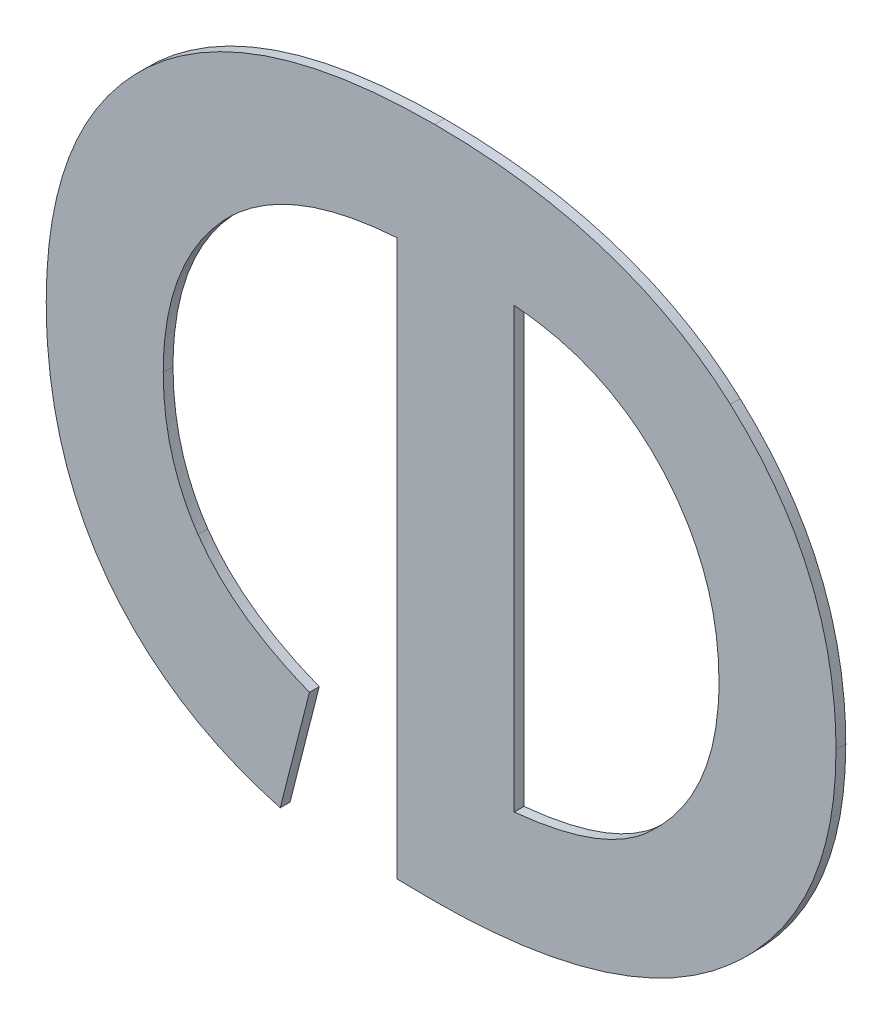
ISO-10303-21;
HEADER;
FILE_DESCRIPTION(('STEP AP214'),'2;1');
FILE_NAME('part.step','',(''),(''),'','','');
FILE_SCHEMA(('AUTOMOTIVE_DESIGN { 1 0 10303 214 1 1 1 1 }'));
ENDSEC;
DATA;
#1=APPLICATION_CONTEXT('core data for automotive mechanical design processes');
#2=APPLICATION_PROTOCOL_DEFINITION('international standard','automotive_design',2000,#1);
#3=PRODUCT_CONTEXT('',#1,'mechanical');
#4=PRODUCT('Part','Part','',(#3));
#5=PRODUCT_RELATED_PRODUCT_CATEGORY('part','',(#4));
#6=PRODUCT_DEFINITION_FORMATION('','',#4);
#7=PRODUCT_DEFINITION_CONTEXT('part definition',#1,'design');
#8=PRODUCT_DEFINITION('design','',#6,#7);
#9=PRODUCT_DEFINITION_SHAPE('','',#8);
#10=(LENGTH_UNIT() NAMED_UNIT(*) SI_UNIT(.MILLI.,.METRE.));
#11=(NAMED_UNIT(*) PLANE_ANGLE_UNIT() SI_UNIT($,.RADIAN.));
#12=(NAMED_UNIT(*) SI_UNIT($,.STERADIAN.) SOLID_ANGLE_UNIT());
#13=UNCERTAINTY_MEASURE_WITH_UNIT(LENGTH_MEASURE(1.E-05),#10,'distance_accuracy_value','');
#14=(GEOMETRIC_REPRESENTATION_CONTEXT(3) GLOBAL_UNCERTAINTY_ASSIGNED_CONTEXT((#13)) GLOBAL_UNIT_ASSIGNED_CONTEXT((#10,
#11,#12)) REPRESENTATION_CONTEXT('',''));
#15=CARTESIAN_POINT('',(0.,0.,0.));
#16=DIRECTION('',(0.,0.,1.));
#17=DIRECTION('',(1.,0.,0.));
#18=AXIS2_PLACEMENT_3D('',#15,#16,#17);
#19=CARTESIAN_POINT('',(1.095228086098,1.4447048737362,1.7496000059366));
#20=DIRECTION('',(0.968996414651314,-0.247074782996766,0.));
#21=DIRECTION('',(0.,0.,-1.));
#22=AXIS2_PLACEMENT_3D('',#19,#20,#21);
#23=PLANE('',#22);
#24=DIRECTION('',(0.,0.,1.));
#25=VECTOR('',#24,1.);
#26=CARTESIAN_POINT('',(1.0958259629557,1.4470496720377,1.7492000059366));
#27=LINE('',#26,#25);
#28=CARTESIAN_POINT('',(1.0958259629557,1.4470496720377,1.7492000059366));
#29=VERTEX_POINT('',#28);
#30=CARTESIAN_POINT('',(1.0958259629557,1.4470496720377,1.7496000059366));
#31=VERTEX_POINT('',#30);
#32=EDGE_CURVE('E11',#29,#31,#27,.T.);
#33=ORIENTED_EDGE('',*,*,#32,.T.);
#34=DIRECTION('',(-0.247074782996766,-0.968996414651314,0.));
#35=VECTOR('',#34,1.);
#36=CARTESIAN_POINT('',(1.0958259629557,1.4470496720377,1.7496000059366));
#37=LINE('',#36,#35);
#38=CARTESIAN_POINT('',(1.0946302092403,1.4423600754347,1.7496000059366));
#39=VERTEX_POINT('',#38);
#40=EDGE_CURVE('E24',#31,#39,#37,.T.);
#41=ORIENTED_EDGE('',*,*,#40,.T.);
#42=DIRECTION('',(0.,0.,1.));
#43=VECTOR('',#42,1.);
#44=CARTESIAN_POINT('',(1.0946302092403,1.4423600754347,1.7492000059366));
#45=LINE('',#44,#43);
#46=CARTESIAN_POINT('',(1.0946302092403,1.4423600754347,1.7492000059366));
#47=VERTEX_POINT('',#46);
#48=EDGE_CURVE('E482',#47,#39,#45,.T.);
#49=ORIENTED_EDGE('',*,*,#48,.F.);
#50=DIRECTION('',(-0.247074782996766,-0.968996414651314,0.));
#51=VECTOR('',#50,1.);
#52=CARTESIAN_POINT('',(1.0958259629557,1.4470496720377,1.7492000059366));
#53=LINE('',#52,#51);
#54=EDGE_CURVE('E476',#29,#47,#53,.T.);
#55=ORIENTED_EDGE('',*,*,#54,.F.);
#56=EDGE_LOOP('',(#33,#41,#49,#55));
#57=FACE_BOUND('',#56,.T.);
#58=ADVANCED_FACE('F17',(#57),#23,.T.);
#59=CARTESIAN_POINT('',(1.0946302092403,1.4423600754347,1.7496000059366));
#60=CARTESIAN_POINT('',(1.0946302092403,1.4423600754347,1.7491200059366));
#61=CARTESIAN_POINT('',(1.0900900818517,1.4435931964537,1.7496000059366));
#62=CARTESIAN_POINT('',(1.0900900818517,1.4435931964537,1.7491200059366));
#63=CARTESIAN_POINT('',(1.0875677888581,1.4469375701269,1.7496000059366));
#64=CARTESIAN_POINT('',(1.0875677888581,1.4469375701269,1.7491200059366));
#65=B_SPLINE_SURFACE_WITH_KNOTS('',2,1,((#59,#60),(#61,#62),(#63,#64)),.UNSPECIFIED.,.F.,.F.,
.F.,(3,3),(2,2),(0.,1.),(0.,0.000239999999999974),.UNSPECIFIED.);
#66=CARTESIAN_POINT('',(1.0946302092403,1.4423600754347,1.7496000059366));
#67=CARTESIAN_POINT('',(1.0900900818517,1.4435931964537,1.7496000059366));
#68=CARTESIAN_POINT('',(1.0875677888581,1.4469375701269,1.7496000059366));
#69=B_SPLINE_CURVE_WITH_KNOTS('',2,(#66,#67,#68),.UNSPECIFIED.,.F.,.F.,(3,3),(0.,1.),.UNSPECIFIED.);
#70=CARTESIAN_POINT('',(1.0875677888581,1.4469375701269,1.7496000059366));
#71=VERTEX_POINT('',#70);
#72=EDGE_CURVE('E472',#39,#71,#69,.T.);
#73=DIRECTION('',(0.,0.,1.));
#74=VECTOR('',#73,1.);
#75=CARTESIAN_POINT('',(1.0875677888581,1.4469375701269,1.7492000059366));
#76=LINE('',#75,#74);
#77=CARTESIAN_POINT('',(1.0875677888581,1.4469375701269,1.7492000059366));
#78=VERTEX_POINT('',#77);
#79=EDGE_CURVE('E466',#78,#71,#76,.T.);
#80=CARTESIAN_POINT('',(1.0946302092403,1.4423600754347,1.7492000059366));
#81=CARTESIAN_POINT('',(1.0900900818517,1.4435931964537,1.7492000059366));
#82=CARTESIAN_POINT('',(1.0875677888581,1.4469375701269,1.7492000059366));
#83=B_SPLINE_CURVE_WITH_KNOTS('',2,(#80,#81,#82),.UNSPECIFIED.,.F.,.F.,(3,3),(0.,1.),.UNSPECIFIED.);
#84=EDGE_CURVE('E458',#47,#78,#83,.T.);
#85=ORIENTED_EDGE('',*,*,#48,.T.);
#86=ORIENTED_EDGE('',*,*,#72,.T.);
#87=ORIENTED_EDGE('',*,*,#79,.F.);
#88=ORIENTED_EDGE('',*,*,#84,.F.);
#89=EDGE_LOOP('',(#85,#86,#87,#88));
#90=FACE_BOUND('',#89,.T.);
#91=ADVANCED_FACE('F489',(#90),#65,.T.);
#92=CARTESIAN_POINT('',(1.0875677888581,1.4469375701269,1.7496000059366));
#93=CARTESIAN_POINT('',(1.0875677888581,1.4469375701269,1.7491200059366));
#94=CARTESIAN_POINT('',(1.0850641795163,1.4502819437999,1.7496000059366));
#95=CARTESIAN_POINT('',(1.0850641795163,1.4502819437999,1.7491200059366));
#96=CARTESIAN_POINT('',(1.0850641795163,1.4554946826533,1.7496000059366));
#97=CARTESIAN_POINT('',(1.0850641795163,1.4554946826533,1.7491200059366));
#98=B_SPLINE_SURFACE_WITH_KNOTS('',2,1,((#92,#93),(#94,#95),(#96,#97)),.UNSPECIFIED.,.F.,.F.,
.F.,(3,3),(2,2),(0.,1.),(0.,0.000239999999999974),.UNSPECIFIED.);
#99=CARTESIAN_POINT('',(1.0875677888581,1.4469375701269,1.7496000059366));
#100=CARTESIAN_POINT('',(1.0850641795163,1.4502819437999,1.7496000059366));
#101=CARTESIAN_POINT('',(1.0850641795163,1.4554946826533,1.7496000059366));
#102=B_SPLINE_CURVE_WITH_KNOTS('',2,(#99,#100,#101),.UNSPECIFIED.,.F.,.F.,(3,3),(0.,1.),.UNSPECIFIED.);
#103=CARTESIAN_POINT('',(1.0850641795163,1.4554946826533,1.7496000059366));
#104=VERTEX_POINT('',#103);
#105=EDGE_CURVE('E454',#71,#104,#102,.T.);
#106=DIRECTION('',(0.,0.,1.));
#107=VECTOR('',#106,1.);
#108=CARTESIAN_POINT('',(1.0850641795163,1.4554946826533,1.7492000059366));
#109=LINE('',#108,#107);
#110=CARTESIAN_POINT('',(1.0850641795163,1.4554946826533,1.7492000059366));
#111=VERTEX_POINT('',#110);
#112=EDGE_CURVE('E448',#111,#104,#109,.T.);
#113=CARTESIAN_POINT('',(1.0875677888581,1.4469375701269,1.7492000059366));
#114=CARTESIAN_POINT('',(1.0850641795163,1.4502819437999,1.7492000059366));
#115=CARTESIAN_POINT('',(1.0850641795163,1.4554946826533,1.7492000059366));
#116=B_SPLINE_CURVE_WITH_KNOTS('',2,(#113,#114,#115),.UNSPECIFIED.,.F.,.F.,(3,3),(0.,1.),.UNSPECIFIED.);
#117=EDGE_CURVE('E440',#78,#111,#116,.T.);
#118=ORIENTED_EDGE('',*,*,#79,.T.);
#119=ORIENTED_EDGE('',*,*,#105,.T.);
#120=ORIENTED_EDGE('',*,*,#112,.F.);
#121=ORIENTED_EDGE('',*,*,#117,.F.);
#122=EDGE_LOOP('',(#118,#119,#120,#121));
#123=FACE_BOUND('',#122,.T.);
#124=ADVANCED_FACE('F496',(#123),#98,.T.);
#125=CARTESIAN_POINT('',(1.0850641795163,1.4554946826533,1.7496000059366));
#126=CARTESIAN_POINT('',(1.0850641795163,1.4554946826533,1.7491200059366));
#127=CARTESIAN_POINT('',(1.0850641795163,1.4620339607849,1.7496000059366));
#128=CARTESIAN_POINT('',(1.0850641795163,1.4620339607849,1.7491200059366));
#129=CARTESIAN_POINT('',(1.0892306338687,1.4658827930567,1.7496000059366));
#130=CARTESIAN_POINT('',(1.0892306338687,1.4658827930567,1.7491200059366));
#131=B_SPLINE_SURFACE_WITH_KNOTS('',2,1,((#125,#126),(#127,#128),(#129,#130)),.UNSPECIFIED.,.F.,
.F.,.F.,(3,3),(2,2),(0.,1.),(0.,0.000239999999999974),.UNSPECIFIED.);
#132=CARTESIAN_POINT('',(1.0850641795163,1.4554946826533,1.7496000059366));
#133=CARTESIAN_POINT('',(1.0850641795163,1.4620339607849,1.7496000059366));
#134=CARTESIAN_POINT('',(1.0892306338687,1.4658827930567,1.7496000059366));
#135=B_SPLINE_CURVE_WITH_KNOTS('',2,(#132,#133,#134),.UNSPECIFIED.,.F.,.F.,(3,3),(0.,1.),.UNSPECIFIED.);
#136=CARTESIAN_POINT('',(1.0892306338687,1.4658827930567,1.7496000059366));
#137=VERTEX_POINT('',#136);
#138=EDGE_CURVE('E436',#104,#137,#135,.T.);
#139=DIRECTION('',(0.,0.,1.));
#140=VECTOR('',#139,1.);
#141=CARTESIAN_POINT('',(1.0892306338687,1.4658827930567,1.7492000059366));
#142=LINE('',#141,#140);
#143=CARTESIAN_POINT('',(1.0892306338687,1.4658827930567,1.7492000059366));
#144=VERTEX_POINT('',#143);
#145=EDGE_CURVE('E430',#144,#137,#142,.T.);
#146=CARTESIAN_POINT('',(1.0850641795163,1.4554946826533,1.7492000059366));
#147=CARTESIAN_POINT('',(1.0850641795163,1.4620339607849,1.7492000059366));
#148=CARTESIAN_POINT('',(1.0892306338687,1.4658827930567,1.7492000059366));
#149=B_SPLINE_CURVE_WITH_KNOTS('',2,(#146,#147,#148),.UNSPECIFIED.,.F.,.F.,(3,3),(0.,1.),.UNSPECIFIED.);
#150=EDGE_CURVE('E422',#111,#144,#149,.T.);
#151=ORIENTED_EDGE('',*,*,#112,.T.);
#152=ORIENTED_EDGE('',*,*,#138,.T.);
#153=ORIENTED_EDGE('',*,*,#145,.F.);
#154=ORIENTED_EDGE('',*,*,#150,.F.);
#155=EDGE_LOOP('',(#151,#152,#153,#154));
#156=FACE_BOUND('',#155,.T.);
#157=ADVANCED_FACE('F500',(#156),#131,.T.);
#158=CARTESIAN_POINT('',(1.0892306338687,1.4658827930567,1.7496000059366));
#159=CARTESIAN_POINT('',(1.0892306338687,1.4658827930567,1.7491200059366));
#160=CARTESIAN_POINT('',(1.0934157718729,1.4697129416767,1.7496000059366));
#161=CARTESIAN_POINT('',(1.0934157718729,1.4697129416767,1.7491200059366));
#162=CARTESIAN_POINT('',(1.1009452835503,1.4697129416767,1.7496000059366));
#163=CARTESIAN_POINT('',(1.1009452835503,1.4697129416767,1.7491200059366));
#164=B_SPLINE_SURFACE_WITH_KNOTS('',2,1,((#158,#159),(#160,#161),(#162,#163)),.UNSPECIFIED.,.F.,
.F.,.F.,(3,3),(2,2),(0.,1.),(0.,0.000239999999999974),.UNSPECIFIED.);
#165=CARTESIAN_POINT('',(1.0892306338687,1.4658827930567,1.7496000059366));
#166=CARTESIAN_POINT('',(1.0934157718729,1.4697129416767,1.7496000059366));
#167=CARTESIAN_POINT('',(1.1009452835503,1.4697129416767,1.7496000059366));
#168=B_SPLINE_CURVE_WITH_KNOTS('',2,(#165,#166,#167),.UNSPECIFIED.,.F.,.F.,(3,3),(0.,1.),.UNSPECIFIED.);
#169=CARTESIAN_POINT('',(1.1009452835503,1.4697129416767,1.7496000059366));
#170=VERTEX_POINT('',#169);
#171=EDGE_CURVE('E418',#137,#170,#168,.T.);
#172=DIRECTION('',(0.,0.,1.));
#173=VECTOR('',#172,1.);
#174=CARTESIAN_POINT('',(1.1009452835503,1.4697129416767,1.7492000059366));
#175=LINE('',#174,#173);
#176=CARTESIAN_POINT('',(1.1009452835503,1.4697129416767,1.7492000059366));
#177=VERTEX_POINT('',#176);
#178=EDGE_CURVE('E412',#177,#170,#175,.T.);
#179=CARTESIAN_POINT('',(1.0892306338687,1.4658827930567,1.7492000059366));
#180=CARTESIAN_POINT('',(1.0934157718729,1.4697129416767,1.7492000059366));
#181=CARTESIAN_POINT('',(1.1009452835503,1.4697129416767,1.7492000059366));
#182=B_SPLINE_CURVE_WITH_KNOTS('',2,(#179,#180,#181),.UNSPECIFIED.,.F.,.F.,(3,3),(0.,1.),.UNSPECIFIED.);
#183=EDGE_CURVE('E404',#144,#177,#182,.T.);
#184=ORIENTED_EDGE('',*,*,#145,.T.);
#185=ORIENTED_EDGE('',*,*,#171,.T.);
#186=ORIENTED_EDGE('',*,*,#178,.F.);
#187=ORIENTED_EDGE('',*,*,#183,.F.);
#188=EDGE_LOOP('',(#184,#185,#186,#187));
#189=FACE_BOUND('',#188,.T.);
#190=ADVANCED_FACE('F505',(#189),#164,.T.);
#191=CARTESIAN_POINT('',(1.1009452835503,1.4697129416767,1.7496000059366));
#192=CARTESIAN_POINT('',(1.1009452835503,1.4697129416767,1.7491200059366));
#193=CARTESIAN_POINT('',(1.1087363663529,1.4697129416767,1.7496000059366));
#194=CARTESIAN_POINT('',(1.1087363663529,1.4697129416767,1.7491200059366));
#195=CARTESIAN_POINT('',(1.1130336062679,1.4658454257531,1.7496000059366));
#196=CARTESIAN_POINT('',(1.1130336062679,1.4658454257531,1.7491200059366));
#197=B_SPLINE_SURFACE_WITH_KNOTS('',2,1,((#191,#192),(#193,#194),(#195,#196)),.UNSPECIFIED.,.F.,
.F.,.F.,(3,3),(2,2),(0.,1.),(0.,0.000239999999999974),.UNSPECIFIED.);
#198=CARTESIAN_POINT('',(1.1009452835503,1.4697129416767,1.7496000059366));
#199=CARTESIAN_POINT('',(1.1087363663529,1.4697129416767,1.7496000059366));
#200=CARTESIAN_POINT('',(1.1130336062679,1.4658454257531,1.7496000059366));
#201=B_SPLINE_CURVE_WITH_KNOTS('',2,(#198,#199,#200),.UNSPECIFIED.,.F.,.F.,(3,3),(0.,1.),.UNSPECIFIED.);
#202=CARTESIAN_POINT('',(1.1130336062679,1.4658454257531,1.7496000059366));
#203=VERTEX_POINT('',#202);
#204=EDGE_CURVE('E400',#170,#203,#201,.T.);
#205=DIRECTION('',(0.,0.,1.));
#206=VECTOR('',#205,1.);
#207=CARTESIAN_POINT('',(1.1130336062679,1.4658454257531,1.7492000059366));
#208=LINE('',#207,#206);
#209=CARTESIAN_POINT('',(1.1130336062679,1.4658454257531,1.7492000059366));
#210=VERTEX_POINT('',#209);
#211=EDGE_CURVE('E394',#210,#203,#208,.T.);
#212=CARTESIAN_POINT('',(1.1009452835503,1.4697129416767,1.7492000059366));
#213=CARTESIAN_POINT('',(1.1087363663529,1.4697129416767,1.7492000059366));
#214=CARTESIAN_POINT('',(1.1130336062679,1.4658454257531,1.7492000059366));
#215=B_SPLINE_CURVE_WITH_KNOTS('',2,(#212,#213,#214),.UNSPECIFIED.,.F.,.F.,(3,3),(0.,1.),.UNSPECIFIED.);
#216=EDGE_CURVE('E386',#177,#210,#215,.T.);
#217=ORIENTED_EDGE('',*,*,#178,.T.);
#218=ORIENTED_EDGE('',*,*,#204,.T.);
#219=ORIENTED_EDGE('',*,*,#211,.F.);
#220=ORIENTED_EDGE('',*,*,#216,.F.);
#221=EDGE_LOOP('',(#217,#218,#219,#220));
#222=FACE_BOUND('',#221,.T.);
#223=ADVANCED_FACE('F508',(#222),#197,.T.);
#224=CARTESIAN_POINT('',(1.1130336062679,1.4658454257531,1.7496000059366));
#225=CARTESIAN_POINT('',(1.1130336062679,1.4658454257531,1.7491200059366));
#226=CARTESIAN_POINT('',(1.1173495298347,1.4619592261777,1.7496000059366));
#227=CARTESIAN_POINT('',(1.1173495298347,1.4619592261777,1.7491200059366));
#228=CARTESIAN_POINT('',(1.1173495298347,1.4557749374305,1.7496000059366));
#229=CARTESIAN_POINT('',(1.1173495298347,1.4557749374305,1.7491200059366));
#230=B_SPLINE_SURFACE_WITH_KNOTS('',2,1,((#224,#225),(#226,#227),(#228,#229)),.UNSPECIFIED.,.F.,
.F.,.F.,(3,3),(2,2),(0.,1.),(0.,0.000239999999999974),.UNSPECIFIED.);
#231=CARTESIAN_POINT('',(1.1130336062679,1.4658454257531,1.7496000059366));
#232=CARTESIAN_POINT('',(1.1173495298347,1.4619592261777,1.7496000059366));
#233=CARTESIAN_POINT('',(1.1173495298347,1.4557749374305,1.7496000059366));
#234=B_SPLINE_CURVE_WITH_KNOTS('',2,(#231,#232,#233),.UNSPECIFIED.,.F.,.F.,(3,3),(0.,1.),.UNSPECIFIED.);
#235=CARTESIAN_POINT('',(1.1173495298347,1.4557749374305,1.7496000059366));
#236=VERTEX_POINT('',#235);
#237=EDGE_CURVE('E382',#203,#236,#234,.T.);
#238=DIRECTION('',(0.,0.,1.));
#239=VECTOR('',#238,1.);
#240=CARTESIAN_POINT('',(1.1173495298347,1.4557749374305,1.7492000059366));
#241=LINE('',#240,#239);
#242=CARTESIAN_POINT('',(1.1173495298347,1.4557749374305,1.7492000059366));
#243=VERTEX_POINT('',#242);
#244=EDGE_CURVE('E376',#243,#236,#241,.T.);
#245=CARTESIAN_POINT('',(1.1130336062679,1.4658454257531,1.7492000059366));
#246=CARTESIAN_POINT('',(1.1173495298347,1.4619592261777,1.7492000059366));
#247=CARTESIAN_POINT('',(1.1173495298347,1.4557749374305,1.7492000059366));
#248=B_SPLINE_CURVE_WITH_KNOTS('',2,(#245,#246,#247),.UNSPECIFIED.,.F.,.F.,(3,3),(0.,1.),.UNSPECIFIED.);
#249=EDGE_CURVE('E368',#210,#243,#248,.T.);
#250=ORIENTED_EDGE('',*,*,#211,.T.);
#251=ORIENTED_EDGE('',*,*,#237,.T.);
#252=ORIENTED_EDGE('',*,*,#244,.F.);
#253=ORIENTED_EDGE('',*,*,#249,.F.);
#254=EDGE_LOOP('',(#250,#251,#252,#253));
#255=FACE_BOUND('',#254,.T.);
#256=ADVANCED_FACE('F513',(#255),#230,.T.);
#257=CARTESIAN_POINT('',(1.1173495298347,1.4557749374305,1.7496000059366));
#258=CARTESIAN_POINT('',(1.1173495298347,1.4557749374305,1.7491200059366));
#259=CARTESIAN_POINT('',(1.1173495298347,1.4497961688529,1.7496000059366));
#260=CARTESIAN_POINT('',(1.1173495298347,1.4497961688529,1.7491200059366));
#261=CARTESIAN_POINT('',(1.1130149226161,1.4460033875365,1.7496000059366));
#262=CARTESIAN_POINT('',(1.1130149226161,1.4460033875365,1.7491200059366));
#263=B_SPLINE_SURFACE_WITH_KNOTS('',2,1,((#257,#258),(#259,#260),(#261,#262)),.UNSPECIFIED.,.F.,
.F.,.F.,(3,3),(2,2),(0.,1.),(0.,0.000239999999999974),.UNSPECIFIED.);
#264=CARTESIAN_POINT('',(1.1173495298347,1.4557749374305,1.7496000059366));
#265=CARTESIAN_POINT('',(1.1173495298347,1.4497961688529,1.7496000059366));
#266=CARTESIAN_POINT('',(1.1130149226161,1.4460033875365,1.7496000059366));
#267=B_SPLINE_CURVE_WITH_KNOTS('',2,(#264,#265,#266),.UNSPECIFIED.,.F.,.F.,(3,3),(0.,1.),.UNSPECIFIED.);
#268=CARTESIAN_POINT('',(1.1130149226161,1.4460033875365,1.7496000059366));
#269=VERTEX_POINT('',#268);
#270=EDGE_CURVE('E364',#236,#269,#267,.T.);
#271=DIRECTION('',(0.,0.,1.));
#272=VECTOR('',#271,1.);
#273=CARTESIAN_POINT('',(1.1130149226161,1.4460033875365,1.7492000059366));
#274=LINE('',#273,#272);
#275=CARTESIAN_POINT('',(1.1130149226161,1.4460033875365,1.7492000059366));
#276=VERTEX_POINT('',#275);
#277=EDGE_CURVE('E358',#276,#269,#274,.T.);
#278=CARTESIAN_POINT('',(1.1173495298347,1.4557749374305,1.7492000059366));
#279=CARTESIAN_POINT('',(1.1173495298347,1.4497961688529,1.7492000059366));
#280=CARTESIAN_POINT('',(1.1130149226161,1.4460033875365,1.7492000059366));
#281=B_SPLINE_CURVE_WITH_KNOTS('',2,(#278,#279,#280),.UNSPECIFIED.,.F.,.F.,(3,3),(0.,1.),.UNSPECIFIED.);
#282=EDGE_CURVE('E350',#243,#276,#281,.T.);
#283=ORIENTED_EDGE('',*,*,#244,.T.);
#284=ORIENTED_EDGE('',*,*,#270,.T.);
#285=ORIENTED_EDGE('',*,*,#277,.F.);
#286=ORIENTED_EDGE('',*,*,#282,.F.);
#287=EDGE_LOOP('',(#283,#284,#285,#286));
#288=FACE_BOUND('',#287,.T.);
#289=ADVANCED_FACE('F517',(#288),#263,.T.);
#290=CARTESIAN_POINT('',(1.1130149226161,1.4460033875365,1.7496000059366));
#291=CARTESIAN_POINT('',(1.1130149226161,1.4460033875365,1.7491200059366));
#292=CARTESIAN_POINT('',(1.1086989990493,1.4422106062203,1.7496000059366));
#293=CARTESIAN_POINT('',(1.1086989990493,1.4422106062203,1.7491200059366));
#294=CARTESIAN_POINT('',(1.1008518652913,1.4422106062203,1.7496000059366));
#295=CARTESIAN_POINT('',(1.1008518652913,1.4422106062203,1.7491200059366));
#296=B_SPLINE_SURFACE_WITH_KNOTS('',2,1,((#290,#291),(#292,#293),(#294,#295)),.UNSPECIFIED.,.F.,
.F.,.F.,(3,3),(2,2),(0.,1.),(0.,0.000239999999999974),.UNSPECIFIED.);
#297=CARTESIAN_POINT('',(1.1130149226161,1.4460033875365,1.7496000059366));
#298=CARTESIAN_POINT('',(1.1086989990493,1.4422106062203,1.7496000059366));
#299=CARTESIAN_POINT('',(1.1008518652913,1.4422106062203,1.7496000059366));
#300=B_SPLINE_CURVE_WITH_KNOTS('',2,(#297,#298,#299),.UNSPECIFIED.,.F.,.F.,(3,3),(0.,1.),.UNSPECIFIED.);
#301=CARTESIAN_POINT('',(1.1008518652913,1.4422106062203,1.7496000059366));
#302=VERTEX_POINT('',#301);
#303=EDGE_CURVE('E346',#269,#302,#300,.T.);
#304=DIRECTION('',(0.,0.,1.));
#305=VECTOR('',#304,1.);
#306=CARTESIAN_POINT('',(1.1008518652913,1.4422106062203,1.7492000059366));
#307=LINE('',#306,#305);
#308=CARTESIAN_POINT('',(1.1008518652913,1.4422106062203,1.7492000059366));
#309=VERTEX_POINT('',#308);
#310=EDGE_CURVE('E340',#309,#302,#307,.T.);
#311=CARTESIAN_POINT('',(1.1130149226161,1.4460033875365,1.7492000059366));
#312=CARTESIAN_POINT('',(1.1086989990493,1.4422106062203,1.7492000059366));
#313=CARTESIAN_POINT('',(1.1008518652913,1.4422106062203,1.7492000059366));
#314=B_SPLINE_CURVE_WITH_KNOTS('',2,(#311,#312,#313),.UNSPECIFIED.,.F.,.F.,(3,3),(0.,1.),.UNSPECIFIED.);
#315=EDGE_CURVE('E332',#276,#309,#314,.T.);
#316=ORIENTED_EDGE('',*,*,#277,.T.);
#317=ORIENTED_EDGE('',*,*,#303,.T.);
#318=ORIENTED_EDGE('',*,*,#310,.F.);
#319=ORIENTED_EDGE('',*,*,#315,.F.);
#320=EDGE_LOOP('',(#316,#317,#318,#319));
#321=FACE_BOUND('',#320,.T.);
#322=ADVANCED_FACE('F521',(#321),#296,.T.);
#323=CARTESIAN_POINT('',(1.1008518652913,1.4422106062203,1.7496000059366));
#324=CARTESIAN_POINT('',(1.1008518652913,1.4422106062203,1.7491200059366));
#325=CARTESIAN_POINT('',(1.1003660903443,1.4422106062203,1.7496000059366));
#326=CARTESIAN_POINT('',(1.1003660903443,1.4422106062203,1.7491200059366));
#327=CARTESIAN_POINT('',(1.0994132241023,1.4422292898721,1.7496000059366));
#328=CARTESIAN_POINT('',(1.0994132241023,1.4422292898721,1.7491200059366));
#329=B_SPLINE_SURFACE_WITH_KNOTS('',2,1,((#323,#324),(#325,#326),(#327,#328)),.UNSPECIFIED.,.F.,
.F.,.F.,(3,3),(2,2),(0.,1.),(0.,0.000239999999999974),.UNSPECIFIED.);
#330=CARTESIAN_POINT('',(1.1008518652913,1.4422106062203,1.7496000059366));
#331=CARTESIAN_POINT('',(1.1003660903443,1.4422106062203,1.7496000059366));
#332=CARTESIAN_POINT('',(1.0994132241023,1.4422292898721,1.7496000059366));
#333=B_SPLINE_CURVE_WITH_KNOTS('',2,(#330,#331,#332),.UNSPECIFIED.,.F.,.F.,(3,3),(0.,1.),.UNSPECIFIED.);
#334=CARTESIAN_POINT('',(1.0994132241023,1.4422292898721,1.7496000059366));
#335=VERTEX_POINT('',#334);
#336=EDGE_CURVE('E328',#302,#335,#333,.T.);
#337=DIRECTION('',(0.,0.,1.));
#338=VECTOR('',#337,1.);
#339=CARTESIAN_POINT('',(1.0994132241023,1.4422292898721,1.7492000059366));
#340=LINE('',#339,#338);
#341=CARTESIAN_POINT('',(1.0994132241023,1.4422292898721,1.7492000059366));
#342=VERTEX_POINT('',#341);
#343=EDGE_CURVE('E322',#342,#335,#340,.T.);
#344=CARTESIAN_POINT('',(1.1008518652913,1.4422106062203,1.7492000059366));
#345=CARTESIAN_POINT('',(1.1003660903443,1.4422106062203,1.7492000059366));
#346=CARTESIAN_POINT('',(1.0994132241023,1.4422292898721,1.7492000059366));
#347=B_SPLINE_CURVE_WITH_KNOTS('',2,(#344,#345,#346),.UNSPECIFIED.,.F.,.F.,(3,3),(0.,1.),.UNSPECIFIED.);
#348=EDGE_CURVE('E317',#309,#342,#347,.T.);
#349=ORIENTED_EDGE('',*,*,#310,.T.);
#350=ORIENTED_EDGE('',*,*,#336,.T.);
#351=ORIENTED_EDGE('',*,*,#343,.F.);
#352=ORIENTED_EDGE('',*,*,#348,.F.);
#353=EDGE_LOOP('',(#349,#350,#351,#352));
#354=FACE_BOUND('',#353,.T.);
#355=ADVANCED_FACE('F524',(#354),#329,.T.);
#356=CARTESIAN_POINT('',(1.0994132241023,1.4535796083434,1.7496000059366));
#357=DIRECTION('',(-1.,0.,0.));
#358=DIRECTION('',(0.,0.,1.));
#359=AXIS2_PLACEMENT_3D('',#356,#357,#358);
#360=PLANE('',#359);
#361=ORIENTED_EDGE('',*,*,#343,.T.);
#362=DIRECTION('',(0.,1.,0.));
#363=VECTOR('',#362,1.);
#364=CARTESIAN_POINT('',(1.0994132241023,1.4422292898721,1.7496000059366));
#365=LINE('',#364,#363);
#366=CARTESIAN_POINT('',(1.0994132241023,1.4649299268147,1.7496000059366));
#367=VERTEX_POINT('',#366);
#368=EDGE_CURVE('E315',#335,#367,#365,.T.);
#369=ORIENTED_EDGE('',*,*,#368,.T.);
#370=DIRECTION('',(0.,0.,1.));
#371=VECTOR('',#370,1.);
#372=CARTESIAN_POINT('',(1.0994132241023,1.4649299268147,1.7492000059366));
#373=LINE('',#372,#371);
#374=CARTESIAN_POINT('',(1.0994132241023,1.4649299268147,1.7492000059366));
#375=VERTEX_POINT('',#374);
#376=EDGE_CURVE('E312',#375,#367,#373,.T.);
#377=ORIENTED_EDGE('',*,*,#376,.F.);
#378=DIRECTION('',(0.,1.,0.));
#379=VECTOR('',#378,1.);
#380=CARTESIAN_POINT('',(1.0994132241023,1.4422292898721,1.7492000059366));
#381=LINE('',#380,#379);
#382=EDGE_CURVE('E306',#342,#375,#381,.T.);
#383=ORIENTED_EDGE('',*,*,#382,.F.);
#384=EDGE_LOOP('',(#361,#369,#377,#383));
#385=FACE_BOUND('',#384,.T.);
#386=ADVANCED_FACE('F529',(#385),#360,.T.);
#387=CARTESIAN_POINT('',(1.0994132241023,1.4649299268147,1.7496000059366));
#388=CARTESIAN_POINT('',(1.0994132241023,1.4649299268147,1.7491200059366));
#389=CARTESIAN_POINT('',(1.0947796784547,1.4646309883859,1.7496000059366));
#390=CARTESIAN_POINT('',(1.0947796784547,1.4646309883859,1.7491200059366));
#391=CARTESIAN_POINT('',(1.0923134364165,1.4619965934813,1.7496000059366));
#392=CARTESIAN_POINT('',(1.0923134364165,1.4619965934813,1.7491200059366));
#393=B_SPLINE_SURFACE_WITH_KNOTS('',2,1,((#387,#388),(#389,#390),(#391,#392)),.UNSPECIFIED.,.F.,
.F.,.F.,(3,3),(2,2),(0.,1.),(0.,0.000239999999999974),.UNSPECIFIED.);
#394=CARTESIAN_POINT('',(1.0994132241023,1.4649299268147,1.7496000059366));
#395=CARTESIAN_POINT('',(1.0947796784547,1.4646309883859,1.7496000059366));
#396=CARTESIAN_POINT('',(1.0923134364165,1.4619965934813,1.7496000059366));
#397=B_SPLINE_CURVE_WITH_KNOTS('',2,(#394,#395,#396),.UNSPECIFIED.,.F.,.F.,(3,3),(0.,1.),.UNSPECIFIED.);
#398=CARTESIAN_POINT('',(1.0923134364165,1.4619965934813,1.7496000059366));
#399=VERTEX_POINT('',#398);
#400=EDGE_CURVE('E302',#367,#399,#397,.T.);
#401=DIRECTION('',(0.,0.,1.));
#402=VECTOR('',#401,1.);
#403=CARTESIAN_POINT('',(1.0923134364165,1.4619965934813,1.7492000059366));
#404=LINE('',#403,#402);
#405=CARTESIAN_POINT('',(1.0923134364165,1.4619965934813,1.7492000059366));
#406=VERTEX_POINT('',#405);
#407=EDGE_CURVE('E296',#406,#399,#404,.T.);
#408=CARTESIAN_POINT('',(1.0994132241023,1.4649299268147,1.7492000059366));
#409=CARTESIAN_POINT('',(1.0947796784547,1.4646309883859,1.7492000059366));
#410=CARTESIAN_POINT('',(1.0923134364165,1.4619965934813,1.7492000059366));
#411=B_SPLINE_CURVE_WITH_KNOTS('',2,(#408,#409,#410),.UNSPECIFIED.,.F.,.F.,(3,3),(0.,1.),.UNSPECIFIED.);
#412=EDGE_CURVE('E288',#375,#406,#411,.T.);
#413=ORIENTED_EDGE('',*,*,#376,.T.);
#414=ORIENTED_EDGE('',*,*,#400,.T.);
#415=ORIENTED_EDGE('',*,*,#407,.F.);
#416=ORIENTED_EDGE('',*,*,#412,.F.);
#417=EDGE_LOOP('',(#413,#414,#415,#416));
#418=FACE_BOUND('',#417,.T.);
#419=ADVANCED_FACE('F533',(#418),#393,.T.);
#420=CARTESIAN_POINT('',(1.0923134364165,1.4619965934813,1.7496000059366));
#421=CARTESIAN_POINT('',(1.0923134364165,1.4619965934813,1.7491200059366));
#422=CARTESIAN_POINT('',(1.0898471943783,1.4593435149251,1.7496000059366));
#423=CARTESIAN_POINT('',(1.0898471943783,1.4593435149251,1.7491200059366));
#424=CARTESIAN_POINT('',(1.0898471943783,1.4553825807425,1.7496000059366));
#425=CARTESIAN_POINT('',(1.0898471943783,1.4553825807425,1.7491200059366));
#426=B_SPLINE_SURFACE_WITH_KNOTS('',2,1,((#420,#421),(#422,#423),(#424,#425)),.UNSPECIFIED.,.F.,
.F.,.F.,(3,3),(2,2),(0.,1.),(0.,0.000239999999999974),.UNSPECIFIED.);
#427=CARTESIAN_POINT('',(1.0923134364165,1.4619965934813,1.7496000059366));
#428=CARTESIAN_POINT('',(1.0898471943783,1.4593435149251,1.7496000059366));
#429=CARTESIAN_POINT('',(1.0898471943783,1.4553825807425,1.7496000059366));
#430=B_SPLINE_CURVE_WITH_KNOTS('',2,(#427,#428,#429),.UNSPECIFIED.,.F.,.F.,(3,3),(0.,1.),.UNSPECIFIED.);
#431=CARTESIAN_POINT('',(1.0898471943783,1.4553825807425,1.7496000059366));
#432=VERTEX_POINT('',#431);
#433=EDGE_CURVE('E284',#399,#432,#430,.T.);
#434=DIRECTION('',(0.,0.,1.));
#435=VECTOR('',#434,1.);
#436=CARTESIAN_POINT('',(1.0898471943783,1.4553825807425,1.7492000059366));
#437=LINE('',#436,#435);
#438=CARTESIAN_POINT('',(1.0898471943783,1.4553825807425,1.7492000059366));
#439=VERTEX_POINT('',#438);
#440=EDGE_CURVE('E278',#439,#432,#437,.T.);
#441=CARTESIAN_POINT('',(1.0923134364165,1.4619965934813,1.7492000059366));
#442=CARTESIAN_POINT('',(1.0898471943783,1.4593435149251,1.7492000059366));
#443=CARTESIAN_POINT('',(1.0898471943783,1.4553825807425,1.7492000059366));
#444=B_SPLINE_CURVE_WITH_KNOTS('',2,(#441,#442,#443),.UNSPECIFIED.,.F.,.F.,(3,3),(0.,1.),.UNSPECIFIED.);
#445=EDGE_CURVE('E270',#406,#439,#444,.T.);
#446=ORIENTED_EDGE('',*,*,#407,.T.);
#447=ORIENTED_EDGE('',*,*,#433,.T.);
#448=ORIENTED_EDGE('',*,*,#440,.F.);
#449=ORIENTED_EDGE('',*,*,#445,.F.);
#450=EDGE_LOOP('',(#446,#447,#448,#449));
#451=FACE_BOUND('',#450,.T.);
#452=ADVANCED_FACE('F537',(#451),#426,.T.);
#453=CARTESIAN_POINT('',(1.0898471943783,1.4553825807425,1.7496000059366));
#454=CARTESIAN_POINT('',(1.0898471943783,1.4553825807425,1.7491200059366));
#455=CARTESIAN_POINT('',(1.0898471943783,1.4524305637573,1.7496000059366));
#456=CARTESIAN_POINT('',(1.0898471943783,1.4524305637573,1.7491200059366));
#457=CARTESIAN_POINT('',(1.0912671519155,1.4503566784071,1.7496000059366));
#458=CARTESIAN_POINT('',(1.0912671519155,1.4503566784071,1.7491200059366));
#459=B_SPLINE_SURFACE_WITH_KNOTS('',2,1,((#453,#454),(#455,#456),(#457,#458)),.UNSPECIFIED.,.F.,
.F.,.F.,(3,3),(2,2),(0.,1.),(0.,0.000239999999999974),.UNSPECIFIED.);
#460=CARTESIAN_POINT('',(1.0898471943783,1.4553825807425,1.7496000059366));
#461=CARTESIAN_POINT('',(1.0898471943783,1.4524305637573,1.7496000059366));
#462=CARTESIAN_POINT('',(1.0912671519155,1.4503566784071,1.7496000059366));
#463=B_SPLINE_CURVE_WITH_KNOTS('',2,(#460,#461,#462),.UNSPECIFIED.,.F.,.F.,(3,3),(0.,1.),.UNSPECIFIED.);
#464=CARTESIAN_POINT('',(1.0912671519155,1.4503566784071,1.7496000059366));
#465=VERTEX_POINT('',#464);
#466=EDGE_CURVE('E266',#432,#465,#463,.T.);
#467=DIRECTION('',(0.,0.,1.));
#468=VECTOR('',#467,1.);
#469=CARTESIAN_POINT('',(1.0912671519155,1.4503566784071,1.7492000059366));
#470=LINE('',#469,#468);
#471=CARTESIAN_POINT('',(1.0912671519155,1.4503566784071,1.7492000059366));
#472=VERTEX_POINT('',#471);
#473=EDGE_CURVE('E260',#472,#465,#470,.T.);
#474=CARTESIAN_POINT('',(1.0898471943783,1.4553825807425,1.7492000059366));
#475=CARTESIAN_POINT('',(1.0898471943783,1.4524305637573,1.7492000059366));
#476=CARTESIAN_POINT('',(1.0912671519155,1.4503566784071,1.7492000059366));
#477=B_SPLINE_CURVE_WITH_KNOTS('',2,(#474,#475,#476),.UNSPECIFIED.,.F.,.F.,(3,3),(0.,1.),.UNSPECIFIED.);
#478=EDGE_CURVE('E252',#439,#472,#477,.T.);
#479=ORIENTED_EDGE('',*,*,#440,.T.);
#480=ORIENTED_EDGE('',*,*,#466,.T.);
#481=ORIENTED_EDGE('',*,*,#473,.F.);
#482=ORIENTED_EDGE('',*,*,#478,.F.);
#483=EDGE_LOOP('',(#479,#480,#481,#482));
#484=FACE_BOUND('',#483,.T.);
#485=ADVANCED_FACE('F540',(#484),#459,.T.);
#486=CARTESIAN_POINT('',(1.0912671519155,1.4503566784071,1.7496000059366));
#487=CARTESIAN_POINT('',(1.0912671519155,1.4503566784071,1.7491200059366));
#488=CARTESIAN_POINT('',(1.0927057931045,1.4482641094049,1.7496000059366));
#489=CARTESIAN_POINT('',(1.0927057931045,1.4482641094049,1.7491200059366));
#490=CARTESIAN_POINT('',(1.0958259629557,1.4470496720377,1.7496000059366));
#491=CARTESIAN_POINT('',(1.0958259629557,1.4470496720377,1.7491200059366));
#492=B_SPLINE_SURFACE_WITH_KNOTS('',2,1,((#486,#487),(#488,#489),(#490,#491)),.UNSPECIFIED.,.F.,
.F.,.F.,(3,3),(2,2),(0.,1.),(0.,0.000239999999999974),.UNSPECIFIED.);
#493=CARTESIAN_POINT('',(1.0912671519155,1.4503566784071,1.7496000059366));
#494=CARTESIAN_POINT('',(1.0927057931045,1.4482641094049,1.7496000059366));
#495=CARTESIAN_POINT('',(1.0958259629557,1.4470496720377,1.7496000059366));
#496=B_SPLINE_CURVE_WITH_KNOTS('',2,(#493,#494,#495),.UNSPECIFIED.,.F.,.F.,(3,3),(0.,1.),.UNSPECIFIED.);
#497=EDGE_CURVE('E245',#465,#31,#496,.T.);
#498=CARTESIAN_POINT('',(1.0912671519155,1.4503566784071,1.7492000059366));
#499=CARTESIAN_POINT('',(1.0927057931045,1.4482641094049,1.7492000059366));
#500=CARTESIAN_POINT('',(1.0958259629557,1.4470496720377,1.7492000059366));
#501=B_SPLINE_CURVE_WITH_KNOTS('',2,(#498,#499,#500),.UNSPECIFIED.,.F.,.F.,(3,3),(0.,1.),.UNSPECIFIED.);
#502=EDGE_CURVE('E240',#472,#29,#501,.T.);
#503=ORIENTED_EDGE('',*,*,#473,.T.);
#504=ORIENTED_EDGE('',*,*,#497,.T.);
#505=ORIENTED_EDGE('',*,*,#32,.F.);
#506=ORIENTED_EDGE('',*,*,#502,.F.);
#507=EDGE_LOOP('',(#503,#504,#505,#506));
#508=FACE_BOUND('',#507,.T.);
#509=ADVANCED_FACE('F541',(#508),#492,.T.);
#510=CARTESIAN_POINT('',(1.1041962389643,1.4559617739485,1.7496000059366));
#511=DIRECTION('',(1.,0.,0.));
#512=DIRECTION('',(0.,0.,-1.));
#513=AXIS2_PLACEMENT_3D('',#510,#511,#512);
#514=PLANE('',#513);
#515=DIRECTION('',(0.,0.,1.));
#516=VECTOR('',#515,1.);
#517=CARTESIAN_POINT('',(1.1041962389643,1.4649299268147,1.7492000059366));
#518=LINE('',#517,#516);
#519=CARTESIAN_POINT('',(1.1041962389643,1.4649299268147,1.7492000059366));
#520=VERTEX_POINT('',#519);
#521=CARTESIAN_POINT('',(1.1041962389643,1.4649299268147,1.7496000059366));
#522=VERTEX_POINT('',#521);
#523=EDGE_CURVE('E174',#520,#522,#518,.T.);
#524=ORIENTED_EDGE('',*,*,#523,.T.);
#525=DIRECTION('',(0.,-1.,0.));
#526=VECTOR('',#525,1.);
#527=CARTESIAN_POINT('',(1.1041962389643,1.4649299268147,1.7496000059366));
#528=LINE('',#527,#526);
#529=CARTESIAN_POINT('',(1.1041962389643,1.4469936210823,1.7496000059366));
#530=VERTEX_POINT('',#529);
#531=EDGE_CURVE('E237',#522,#530,#528,.T.);
#532=ORIENTED_EDGE('',*,*,#531,.T.);
#533=DIRECTION('',(0.,0.,1.));
#534=VECTOR('',#533,1.);
#535=CARTESIAN_POINT('',(1.1041962389643,1.4469936210823,1.7492000059366));
#536=LINE('',#535,#534);
#537=CARTESIAN_POINT('',(1.1041962389643,1.4469936210823,1.7492000059366));
#538=VERTEX_POINT('',#537);
#539=EDGE_CURVE('E234',#538,#530,#536,.T.);
#540=ORIENTED_EDGE('',*,*,#539,.F.);
#541=DIRECTION('',(0.,-1.,0.));
#542=VECTOR('',#541,1.);
#543=CARTESIAN_POINT('',(1.1041962389643,1.4649299268147,1.7492000059366));
#544=LINE('',#543,#542);
#545=EDGE_CURVE('E229',#520,#538,#544,.T.);
#546=ORIENTED_EDGE('',*,*,#545,.F.);
#547=EDGE_LOOP('',(#524,#532,#540,#546));
#548=FACE_BOUND('',#547,.T.);
#549=ADVANCED_FACE('F543',(#548),#514,.T.);
#550=CARTESIAN_POINT('',(1.1041962389643,1.4469936210823,1.7496000059366));
#551=CARTESIAN_POINT('',(1.1041962389643,1.4469936210823,1.7491200059366));
#552=CARTESIAN_POINT('',(1.1078769183699,1.4473486104665,1.7496000059366));
#553=CARTESIAN_POINT('',(1.1078769183699,1.4473486104665,1.7491200059366));
#554=CARTESIAN_POINT('',(1.1097079162467,1.4490488227807,1.7496000059366));
#555=CARTESIAN_POINT('',(1.1097079162467,1.4490488227807,1.7491200059366));
#556=B_SPLINE_SURFACE_WITH_KNOTS('',2,1,((#550,#551),(#552,#553),(#554,#555)),.UNSPECIFIED.,.F.,
.F.,.F.,(3,3),(2,2),(0.,1.),(0.,0.000239999999999974),.UNSPECIFIED.);
#557=CARTESIAN_POINT('',(1.1041962389643,1.4469936210823,1.7496000059366));
#558=CARTESIAN_POINT('',(1.1078769183699,1.4473486104665,1.7496000059366));
#559=CARTESIAN_POINT('',(1.1097079162467,1.4490488227807,1.7496000059366));
#560=B_SPLINE_CURVE_WITH_KNOTS('',2,(#557,#558,#559),.UNSPECIFIED.,.F.,.F.,(3,3),(0.,1.),.UNSPECIFIED.);
#561=CARTESIAN_POINT('',(1.1097079162467,1.4490488227807,1.7496000059366));
#562=VERTEX_POINT('',#561);
#563=EDGE_CURVE('E225',#530,#562,#560,.T.);
#564=DIRECTION('',(0.,0.,1.));
#565=VECTOR('',#564,1.);
#566=CARTESIAN_POINT('',(1.1097079162467,1.4490488227807,1.7492000059366));
#567=LINE('',#566,#565);
#568=CARTESIAN_POINT('',(1.1097079162467,1.4490488227807,1.7492000059366));
#569=VERTEX_POINT('',#568);
#570=EDGE_CURVE('E219',#569,#562,#567,.T.);
#571=CARTESIAN_POINT('',(1.1041962389643,1.4469936210823,1.7492000059366));
#572=CARTESIAN_POINT('',(1.1078769183699,1.4473486104665,1.7492000059366));
#573=CARTESIAN_POINT('',(1.1097079162467,1.4490488227807,1.7492000059366));
#574=B_SPLINE_CURVE_WITH_KNOTS('',2,(#571,#572,#573),.UNSPECIFIED.,.F.,.F.,(3,3),(0.,1.),.UNSPECIFIED.);
#575=EDGE_CURVE('E212',#538,#569,#574,.T.);
#576=ORIENTED_EDGE('',*,*,#539,.T.);
#577=ORIENTED_EDGE('',*,*,#563,.T.);
#578=ORIENTED_EDGE('',*,*,#570,.F.);
#579=ORIENTED_EDGE('',*,*,#575,.F.);
#580=EDGE_LOOP('',(#576,#577,#578,#579));
#581=FACE_BOUND('',#580,.T.);
#582=ADVANCED_FACE('F550',(#581),#556,.T.);
#583=CARTESIAN_POINT('',(1.1097079162467,1.4490488227807,1.7496000059366));
#584=CARTESIAN_POINT('',(1.1097079162467,1.4490488227807,1.7491200059366));
#585=CARTESIAN_POINT('',(1.1125665149727,1.4516458503815,1.7496000059366));
#586=CARTESIAN_POINT('',(1.1125665149727,1.4516458503815,1.7491200059366));
#587=CARTESIAN_POINT('',(1.1125665149727,1.4557936210823,1.7496000059366));
#588=CARTESIAN_POINT('',(1.1125665149727,1.4557936210823,1.7491200059366));
#589=B_SPLINE_SURFACE_WITH_KNOTS('',2,1,((#583,#584),(#585,#586),(#587,#588)),.UNSPECIFIED.,.F.,
.F.,.F.,(3,3),(2,2),(0.,1.),(0.,0.000239999999999974),.UNSPECIFIED.);
#590=CARTESIAN_POINT('',(1.1097079162467,1.4490488227807,1.7496000059366));
#591=CARTESIAN_POINT('',(1.1125665149727,1.4516458503815,1.7496000059366));
#592=CARTESIAN_POINT('',(1.1125665149727,1.4557936210823,1.7496000059366));
#593=B_SPLINE_CURVE_WITH_KNOTS('',2,(#590,#591,#592),.UNSPECIFIED.,.F.,.F.,(3,3),(0.,1.),.UNSPECIFIED.);
#594=CARTESIAN_POINT('',(1.1125665149727,1.4557936210823,1.7496000059366));
#595=VERTEX_POINT('',#594);
#596=EDGE_CURVE('E208',#562,#595,#593,.T.);
#597=DIRECTION('',(0.,0.,1.));
#598=VECTOR('',#597,1.);
#599=CARTESIAN_POINT('',(1.1125665149727,1.4557936210823,1.7492000059366));
#600=LINE('',#599,#598);
#601=CARTESIAN_POINT('',(1.1125665149727,1.4557936210823,1.7492000059366));
#602=VERTEX_POINT('',#601);
#603=EDGE_CURVE('E203',#602,#595,#600,.T.);
#604=CARTESIAN_POINT('',(1.1097079162467,1.4490488227807,1.7492000059366));
#605=CARTESIAN_POINT('',(1.1125665149727,1.4516458503815,1.7492000059366));
#606=CARTESIAN_POINT('',(1.1125665149727,1.4557936210823,1.7492000059366));
#607=B_SPLINE_CURVE_WITH_KNOTS('',2,(#604,#605,#606),.UNSPECIFIED.,.F.,.F.,(3,3),(0.,1.),.UNSPECIFIED.);
#608=EDGE_CURVE('E170',#569,#602,#607,.T.);
#609=ORIENTED_EDGE('',*,*,#570,.T.);
#610=ORIENTED_EDGE('',*,*,#596,.T.);
#611=ORIENTED_EDGE('',*,*,#603,.F.);
#612=ORIENTED_EDGE('',*,*,#608,.F.);
#613=EDGE_LOOP('',(#609,#610,#611,#612));
#614=FACE_BOUND('',#613,.T.);
#615=ADVANCED_FACE('F700',(#614),#589,.T.);
#616=CARTESIAN_POINT('',(1.1125665149727,1.4557936210823,1.7496000059366));
#617=CARTESIAN_POINT('',(1.1125665149727,1.4557936210823,1.7491200059366));
#618=CARTESIAN_POINT('',(1.1125665149727,1.4595490350949,1.7496000059366));
#619=CARTESIAN_POINT('',(1.1125665149727,1.4595490350949,1.7491200059366));
#620=CARTESIAN_POINT('',(1.1102871094527,1.4621086953923,1.7496000059366));
#621=CARTESIAN_POINT('',(1.1102871094527,1.4621086953923,1.7491200059366));
#622=B_SPLINE_SURFACE_WITH_KNOTS('',2,1,((#616,#617),(#618,#619),(#620,#621)),.UNSPECIFIED.,.F.,
.F.,.F.,(3,3),(2,2),(0.,1.),(0.,0.000239999999999974),.UNSPECIFIED.);
#623=CARTESIAN_POINT('',(1.1125665149727,1.4557936210823,1.7496000059366));
#624=CARTESIAN_POINT('',(1.1125665149727,1.4595490350949,1.7496000059366));
#625=CARTESIAN_POINT('',(1.1102871094527,1.4621086953923,1.7496000059366));
#626=B_SPLINE_CURVE_WITH_KNOTS('',2,(#623,#624,#625),.UNSPECIFIED.,.F.,.F.,(3,3),(0.,1.),.UNSPECIFIED.);
#627=CARTESIAN_POINT('',(1.1102871094527,1.4621086953923,1.7496000059366));
#628=VERTEX_POINT('',#627);
#629=EDGE_CURVE('E156',#595,#628,#626,.T.);
#630=DIRECTION('',(0.,0.,1.));
#631=VECTOR('',#630,1.);
#632=CARTESIAN_POINT('',(1.1102871094527,1.4621086953923,1.7492000059366));
#633=LINE('',#632,#631);
#634=CARTESIAN_POINT('',(1.1102871094527,1.4621086953923,1.7492000059366));
#635=VERTEX_POINT('',#634);
#636=EDGE_CURVE('E150',#635,#628,#633,.T.);
#637=CARTESIAN_POINT('',(1.1125665149727,1.4557936210823,1.7492000059366));
#638=CARTESIAN_POINT('',(1.1125665149727,1.4595490350949,1.7492000059366));
#639=CARTESIAN_POINT('',(1.1102871094527,1.4621086953923,1.7492000059366));
#640=B_SPLINE_CURVE_WITH_KNOTS('',2,(#637,#638,#639),.UNSPECIFIED.,.F.,.F.,(3,3),(0.,1.),.UNSPECIFIED.);
#641=EDGE_CURVE('E154',#602,#635,#640,.T.);
#642=ORIENTED_EDGE('',*,*,#603,.T.);
#643=ORIENTED_EDGE('',*,*,#629,.T.);
#644=ORIENTED_EDGE('',*,*,#636,.F.);
#645=ORIENTED_EDGE('',*,*,#641,.F.);
#646=EDGE_LOOP('',(#642,#643,#644,#645));
#647=FACE_BOUND('',#646,.T.);
#648=ADVANCED_FACE('F153',(#647),#622,.T.);
#649=CARTESIAN_POINT('',(1.1102871094527,1.4621086953923,1.7496000059366));
#650=CARTESIAN_POINT('',(1.1102871094527,1.4621086953923,1.7491200059366));
#651=CARTESIAN_POINT('',(1.1080077039325,1.4646496720377,1.7496000059366));
#652=CARTESIAN_POINT('',(1.1080077039325,1.4646496720377,1.7491200059366));
#653=CARTESIAN_POINT('',(1.1041962389643,1.4649299268147,1.7496000059366));
#654=CARTESIAN_POINT('',(1.1041962389643,1.4649299268147,1.7491200059366));
#655=B_SPLINE_SURFACE_WITH_KNOTS('',2,1,((#649,#650),(#651,#652),(#653,#654)),.UNSPECIFIED.,.F.,
.F.,.F.,(3,3),(2,2),(0.,1.),(0.,0.000239999999999974),.UNSPECIFIED.);
#656=CARTESIAN_POINT('',(1.1102871094527,1.4621086953923,1.7496000059366));
#657=CARTESIAN_POINT('',(1.1080077039325,1.4646496720377,1.7496000059366));
#658=CARTESIAN_POINT('',(1.1041962389643,1.4649299268147,1.7496000059366));
#659=B_SPLINE_CURVE_WITH_KNOTS('',2,(#656,#657,#658),.UNSPECIFIED.,.F.,.F.,(3,3),(0.,1.),.UNSPECIFIED.);
#660=EDGE_CURVE('E171',#628,#522,#659,.T.);
#661=CARTESIAN_POINT('',(1.1102871094527,1.4621086953923,1.7492000059366));
#662=CARTESIAN_POINT('',(1.1080077039325,1.4646496720377,1.7492000059366));
#663=CARTESIAN_POINT('',(1.1041962389643,1.4649299268147,1.7492000059366));
#664=B_SPLINE_CURVE_WITH_KNOTS('',2,(#661,#662,#663),.UNSPECIFIED.,.F.,.F.,(3,3),(0.,1.),.UNSPECIFIED.);
#665=EDGE_CURVE('E167',#635,#520,#664,.T.);
#666=ORIENTED_EDGE('',*,*,#636,.T.);
#667=ORIENTED_EDGE('',*,*,#660,.T.);
#668=ORIENTED_EDGE('',*,*,#523,.F.);
#669=ORIENTED_EDGE('',*,*,#665,.F.);
#670=EDGE_LOOP('',(#666,#667,#668,#669));
#671=FACE_BOUND('',#670,.T.);
#672=ADVANCED_FACE('F173',(#671),#655,.T.);
#673=CARTESIAN_POINT('',(1.0850641795163,1.4559617739485,1.7492000059366));
#674=DIRECTION('',(0.,0.,-1.));
#675=DIRECTION('',(-1.,0.,0.));
#676=AXIS2_PLACEMENT_3D('',#673,#674,#675);
#677=PLANE('',#676);
#678=ORIENTED_EDGE('',*,*,#54,.T.);
#679=ORIENTED_EDGE('',*,*,#84,.T.);
#680=ORIENTED_EDGE('',*,*,#117,.T.);
#681=ORIENTED_EDGE('',*,*,#150,.T.);
#682=ORIENTED_EDGE('',*,*,#183,.T.);
#683=ORIENTED_EDGE('',*,*,#216,.T.);
#684=ORIENTED_EDGE('',*,*,#249,.T.);
#685=ORIENTED_EDGE('',*,*,#282,.T.);
#686=ORIENTED_EDGE('',*,*,#315,.T.);
#687=ORIENTED_EDGE('',*,*,#348,.T.);
#688=ORIENTED_EDGE('',*,*,#382,.T.);
#689=ORIENTED_EDGE('',*,*,#412,.T.);
#690=ORIENTED_EDGE('',*,*,#445,.T.);
#691=ORIENTED_EDGE('',*,*,#478,.T.);
#692=ORIENTED_EDGE('',*,*,#502,.T.);
#693=EDGE_LOOP('',(#678,#679,#680,#681,#682,#683,#684,#685,#686,#687,#688,#689,#690,#691,#692));
#694=FACE_BOUND('',#693,.T.);
#695=ORIENTED_EDGE('',*,*,#545,.T.);
#696=ORIENTED_EDGE('',*,*,#575,.T.);
#697=ORIENTED_EDGE('',*,*,#608,.T.);
#698=ORIENTED_EDGE('',*,*,#641,.T.);
#699=ORIENTED_EDGE('',*,*,#665,.T.);
#700=EDGE_LOOP('',(#695,#696,#697,#698,#699));
#701=FACE_BOUND('',#700,.T.);
#702=ADVANCED_FACE('F166',(#694,#701),#677,.T.);
#703=CARTESIAN_POINT('',(1.0850641795163,1.4559617739485,1.7496000059366));
#704=DIRECTION('',(0.,0.,-1.));
#705=DIRECTION('',(-1.,0.,0.));
#706=AXIS2_PLACEMENT_3D('',#703,#704,#705);
#707=PLANE('',#706);
#708=ORIENTED_EDGE('',*,*,#40,.F.);
#709=ORIENTED_EDGE('',*,*,#497,.F.);
#710=ORIENTED_EDGE('',*,*,#466,.F.);
#711=ORIENTED_EDGE('',*,*,#433,.F.);
#712=ORIENTED_EDGE('',*,*,#400,.F.);
#713=ORIENTED_EDGE('',*,*,#368,.F.);
#714=ORIENTED_EDGE('',*,*,#336,.F.);
#715=ORIENTED_EDGE('',*,*,#303,.F.);
#716=ORIENTED_EDGE('',*,*,#270,.F.);
#717=ORIENTED_EDGE('',*,*,#237,.F.);
#718=ORIENTED_EDGE('',*,*,#204,.F.);
#719=ORIENTED_EDGE('',*,*,#171,.F.);
#720=ORIENTED_EDGE('',*,*,#138,.F.);
#721=ORIENTED_EDGE('',*,*,#105,.F.);
#722=ORIENTED_EDGE('',*,*,#72,.F.);
#723=EDGE_LOOP('',(#708,#709,#710,#711,#712,#713,#714,#715,#716,#717,#718,#719,#720,#721,#722));
#724=FACE_BOUND('',#723,.T.);
#725=ORIENTED_EDGE('',*,*,#531,.F.);
#726=ORIENTED_EDGE('',*,*,#660,.F.);
#727=ORIENTED_EDGE('',*,*,#629,.F.);
#728=ORIENTED_EDGE('',*,*,#596,.F.);
#729=ORIENTED_EDGE('',*,*,#563,.F.);
#730=EDGE_LOOP('',(#725,#726,#727,#728,#729));
#731=FACE_BOUND('',#730,.T.);
#732=ADVANCED_FACE('F491',(#724,#731),#707,.F.);
#733=CLOSED_SHELL('',(#58,#91,#124,#157,#190,#223,#256,#289,#322,#355,#386,#419,#452,#485,#509,
#549,#582,#615,#648,#672,#702,#732));
#734=MANIFOLD_SOLID_BREP('B1',#733);
#735=ADVANCED_BREP_SHAPE_REPRESENTATION('',(#18,#734),#14);
#736=SHAPE_DEFINITION_REPRESENTATION(#9,#735);
ENDSEC;
END-ISO-10303-21;
